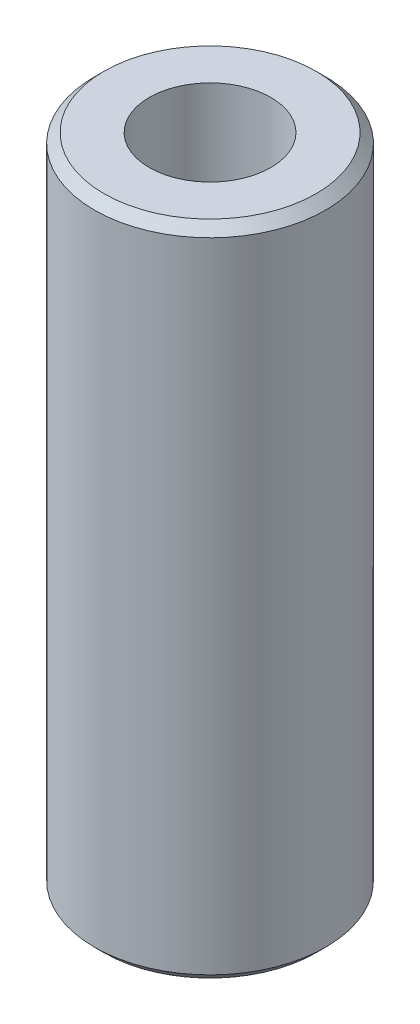
ISO-10303-21;
HEADER;
FILE_DESCRIPTION(('STEP AP214'),'2;1');
FILE_NAME('part.step','',(''),(''),'','','');
FILE_SCHEMA(('AUTOMOTIVE_DESIGN { 1 0 10303 214 1 1 1 1 }'));
ENDSEC;
DATA;
#1=APPLICATION_CONTEXT('core data for automotive mechanical design processes');
#2=APPLICATION_PROTOCOL_DEFINITION('international standard','automotive_design',2000,#1);
#3=PRODUCT_CONTEXT('',#1,'mechanical');
#4=PRODUCT('Part','Part','',(#3));
#5=PRODUCT_RELATED_PRODUCT_CATEGORY('part','',(#4));
#6=PRODUCT_DEFINITION_FORMATION('','',#4);
#7=PRODUCT_DEFINITION_CONTEXT('part definition',#1,'design');
#8=PRODUCT_DEFINITION('design','',#6,#7);
#9=PRODUCT_DEFINITION_SHAPE('','',#8);
#10=(LENGTH_UNIT() NAMED_UNIT(*) SI_UNIT(.MILLI.,.METRE.));
#11=(NAMED_UNIT(*) PLANE_ANGLE_UNIT() SI_UNIT($,.RADIAN.));
#12=(NAMED_UNIT(*) SI_UNIT($,.STERADIAN.) SOLID_ANGLE_UNIT());
#13=UNCERTAINTY_MEASURE_WITH_UNIT(LENGTH_MEASURE(1.E-05),#10,'distance_accuracy_value','');
#14=(GEOMETRIC_REPRESENTATION_CONTEXT(3) GLOBAL_UNCERTAINTY_ASSIGNED_CONTEXT((#13)) GLOBAL_UNIT_ASSIGNED_CONTEXT((#10,
#11,#12)) REPRESENTATION_CONTEXT('',''));
#15=CARTESIAN_POINT('',(0.,0.,0.));
#16=DIRECTION('',(0.,0.,1.));
#17=DIRECTION('',(1.,0.,0.));
#18=AXIS2_PLACEMENT_3D('',#15,#16,#17);
#19=CARTESIAN_POINT('',(0.,270.190778243358,0.));
#20=DIRECTION('',(0.,-1.,0.));
#21=DIRECTION('',(0.,0.,-1.));
#22=AXIS2_PLACEMENT_3D('',#19,#20,#21);
#23=CYLINDRICAL_SURFACE('',#22,47.5);
#24=CARTESIAN_POINT('',(0.,266.286757304008,0.));
#25=DIRECTION('',(0.,1.,0.));
#26=DIRECTION('',(0.,0.,1.));
#27=AXIS2_PLACEMENT_3D('',#24,#25,#26);
#28=CIRCLE('',#27,47.5);
#29=CARTESIAN_POINT('',(0.,266.286757304008,47.5));
#30=VERTEX_POINT('',#29);
#31=EDGE_CURVE('E50',#30,#30,#28,.F.);
#32=ORIENTED_EDGE('',*,*,#31,.T.);
#33=EDGE_LOOP('',(#32));
#34=FACE_BOUND('',#33,.T.);
#35=CARTESIAN_POINT('',(0.,3.90402093935061,0.));
#36=DIRECTION('',(0.,1.,0.));
#37=DIRECTION('',(0.,0.,1.));
#38=AXIS2_PLACEMENT_3D('',#35,#36,#37);
#39=CIRCLE('',#38,47.5);
#40=CARTESIAN_POINT('',(0.,3.90402093935061,47.5));
#41=VERTEX_POINT('',#40);
#42=EDGE_CURVE('E51',#41,#41,#39,.T.);
#43=ORIENTED_EDGE('',*,*,#42,.T.);
#44=EDGE_LOOP('',(#43));
#45=FACE_BOUND('',#44,.T.);
#46=ADVANCED_FACE('F39',(#34,#45),#23,.T.);
#47=CARTESIAN_POINT('',(0.,270.190778243358,0.));
#48=DIRECTION('',(0.,1.,0.));
#49=DIRECTION('',(0.,0.,1.));
#50=AXIS2_PLACEMENT_3D('',#47,#48,#49);
#51=PLANE('',#50);
#52=CARTESIAN_POINT('',(0.,270.190778243358,0.));
#53=DIRECTION('',(0.,1.,0.));
#54=DIRECTION('',(0.,0.,1.));
#55=AXIS2_PLACEMENT_3D('',#52,#53,#54);
#56=CIRCLE('',#55,43.5959790606494);
#57=CARTESIAN_POINT('',(0.,270.190778243358,43.5959790606494));
#58=VERTEX_POINT('',#57);
#59=EDGE_CURVE('E54',#58,#58,#56,.T.);
#60=ORIENTED_EDGE('',*,*,#59,.T.);
#61=EDGE_LOOP('',(#60));
#62=FACE_BOUND('',#61,.T.);
#63=CARTESIAN_POINT('',(0.,270.190778243358,0.));
#64=DIRECTION('',(0.,1.,0.));
#65=DIRECTION('',(0.,0.,1.));
#66=AXIS2_PLACEMENT_3D('',#63,#64,#65);
#67=CIRCLE('',#66,24.9845395868179);
#68=CARTESIAN_POINT('',(0.,270.190778243358,24.9845395868179));
#69=VERTEX_POINT('',#68);
#70=EDGE_CURVE('E58',#69,#69,#67,.T.);
#71=ORIENTED_EDGE('',*,*,#70,.F.);
#72=EDGE_LOOP('',(#71));
#73=FACE_BOUND('',#72,.T.);
#74=ADVANCED_FACE('F69',(#62,#73),#51,.T.);
#75=CARTESIAN_POINT('',(0.,0.,0.));
#76=DIRECTION('',(0.,1.,0.));
#77=DIRECTION('',(0.,0.,1.));
#78=AXIS2_PLACEMENT_3D('',#75,#76,#77);
#79=PLANE('',#78);
#80=CARTESIAN_POINT('',(0.,0.,0.));
#81=DIRECTION('',(0.,1.,0.));
#82=DIRECTION('',(0.,0.,1.));
#83=AXIS2_PLACEMENT_3D('',#80,#81,#82);
#84=CIRCLE('',#83,43.5959790606494);
#85=CARTESIAN_POINT('',(0.,0.,43.5959790606494));
#86=VERTEX_POINT('',#85);
#87=EDGE_CURVE('E10',#86,#86,#84,.F.);
#88=ORIENTED_EDGE('',*,*,#87,.T.);
#89=EDGE_LOOP('',(#88));
#90=FACE_BOUND('',#89,.T.);
#91=CARTESIAN_POINT('',(0.,0.,0.));
#92=DIRECTION('',(0.,1.,0.));
#93=DIRECTION('',(0.,0.,1.));
#94=AXIS2_PLACEMENT_3D('',#91,#92,#93);
#95=CIRCLE('',#94,24.9845395868179);
#96=CARTESIAN_POINT('',(0.,0.,24.9845395868179));
#97=VERTEX_POINT('',#96);
#98=EDGE_CURVE('E63',#97,#97,#95,.T.);
#99=ORIENTED_EDGE('',*,*,#98,.T.);
#100=EDGE_LOOP('',(#99));
#101=FACE_BOUND('',#100,.T.);
#102=ADVANCED_FACE('F75',(#90,#101),#79,.F.);
#103=CARTESIAN_POINT('',(0.,270.190778243358,0.));
#104=DIRECTION('',(0.,-1.,0.));
#105=DIRECTION('',(0.,0.,-1.));
#106=AXIS2_PLACEMENT_3D('',#103,#104,#105);
#107=CYLINDRICAL_SURFACE('',#106,24.9845395868179);
#108=ORIENTED_EDGE('',*,*,#70,.T.);
#109=EDGE_LOOP('',(#108));
#110=FACE_BOUND('',#109,.T.);
#111=ORIENTED_EDGE('',*,*,#98,.F.);
#112=EDGE_LOOP('',(#111));
#113=FACE_BOUND('',#112,.T.);
#114=ADVANCED_FACE('F70',(#110,#113),#107,.F.);
#115=CARTESIAN_POINT('',(0.,270.190778243358,0.));
#116=DIRECTION('',(0.,-1.,0.));
#117=DIRECTION('',(0.,0.,-1.));
#118=AXIS2_PLACEMENT_3D('',#115,#116,#117);
#119=CONICAL_SURFACE('',#118,43.5959790606494,0.785398163397451);
#120=ORIENTED_EDGE('',*,*,#31,.F.);
#121=EDGE_LOOP('',(#120));
#122=FACE_BOUND('',#121,.T.);
#123=ORIENTED_EDGE('',*,*,#59,.F.);
#124=EDGE_LOOP('',(#123));
#125=FACE_BOUND('',#124,.T.);
#126=ADVANCED_FACE('F81',(#122,#125),#119,.T.);
#127=CARTESIAN_POINT('',(0.,3.90402093935061,0.));
#128=DIRECTION('',(0.,1.,0.));
#129=DIRECTION('',(0.,0.,1.));
#130=AXIS2_PLACEMENT_3D('',#127,#128,#129);
#131=CONICAL_SURFACE('',#130,47.5,0.785398163397454);
#132=ORIENTED_EDGE('',*,*,#87,.F.);
#133=EDGE_LOOP('',(#132));
#134=FACE_BOUND('',#133,.T.);
#135=ORIENTED_EDGE('',*,*,#42,.F.);
#136=EDGE_LOOP('',(#135));
#137=FACE_BOUND('',#136,.T.);
#138=ADVANCED_FACE('F45',(#134,#137),#131,.T.);
#139=CLOSED_SHELL('',(#46,#74,#102,#114,#126,#138));
#140=MANIFOLD_SOLID_BREP('B2',#139);
#141=ADVANCED_BREP_SHAPE_REPRESENTATION('',(#18,#140),#14);
#142=SHAPE_DEFINITION_REPRESENTATION(#9,#141);
ENDSEC;
END-ISO-10303-21;
